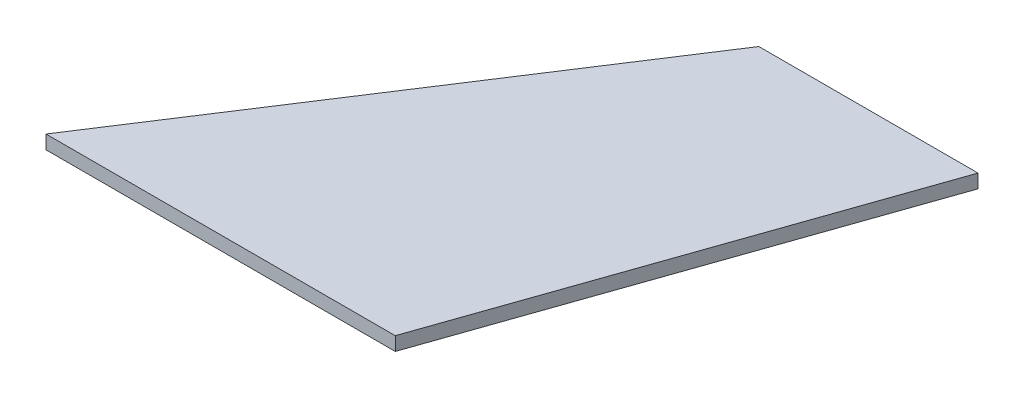
ISO-10303-21;
HEADER;
FILE_DESCRIPTION(('STEP AP214'),'2;1');
FILE_NAME('part.step','',(''),(''),'','','');
FILE_SCHEMA(('AUTOMOTIVE_DESIGN { 1 0 10303 214 1 1 1 1 }'));
ENDSEC;
DATA;
#1=APPLICATION_CONTEXT('core data for automotive mechanical design processes');
#2=APPLICATION_PROTOCOL_DEFINITION('international standard','automotive_design',2000,#1);
#3=PRODUCT_CONTEXT('',#1,'mechanical');
#4=PRODUCT('Part','Part','',(#3));
#5=PRODUCT_RELATED_PRODUCT_CATEGORY('part','',(#4));
#6=PRODUCT_DEFINITION_FORMATION('','',#4);
#7=PRODUCT_DEFINITION_CONTEXT('part definition',#1,'design');
#8=PRODUCT_DEFINITION('design','',#6,#7);
#9=PRODUCT_DEFINITION_SHAPE('','',#8);
#10=(LENGTH_UNIT() NAMED_UNIT(*) SI_UNIT(.MILLI.,.METRE.));
#11=(NAMED_UNIT(*) PLANE_ANGLE_UNIT() SI_UNIT($,.RADIAN.));
#12=(NAMED_UNIT(*) SI_UNIT($,.STERADIAN.) SOLID_ANGLE_UNIT());
#13=UNCERTAINTY_MEASURE_WITH_UNIT(LENGTH_MEASURE(1.E-05),#10,'distance_accuracy_value','');
#14=(GEOMETRIC_REPRESENTATION_CONTEXT(3) GLOBAL_UNCERTAINTY_ASSIGNED_CONTEXT((#13)) GLOBAL_UNIT_ASSIGNED_CONTEXT((#10,
#11,#12)) REPRESENTATION_CONTEXT('',''));
#15=CARTESIAN_POINT('',(0.,0.,0.));
#16=DIRECTION('',(0.,0.,1.));
#17=DIRECTION('',(1.,0.,0.));
#18=AXIS2_PLACEMENT_3D('',#15,#16,#17);
#19=CARTESIAN_POINT('',(0.,1.,0.));
#20=DIRECTION('',(-0.838670567945425,0.,-0.544639035015025));
#21=DIRECTION('',(-0.544639035015025,0.,0.838670567945425));
#22=AXIS2_PLACEMENT_3D('',#19,#20,#21);
#23=PLANE('',#22);
#24=DIRECTION('',(0.544639035015025,0.,-0.838670567945425));
#25=VECTOR('',#24,1.);
#26=CARTESIAN_POINT('',(0.,-1.,0.));
#27=LINE('',#26,#25);
#28=CARTESIAN_POINT('',(0.,-1.,0.));
#29=VERTEX_POINT('',#28);
#30=CARTESIAN_POINT('',(40.9837172018699,-1.,-63.1093902060448));
#31=VERTEX_POINT('',#30);
#32=EDGE_CURVE('E100',#29,#31,#27,.T.);
#33=ORIENTED_EDGE('',*,*,#32,.F.);
#34=DIRECTION('',(0.,-1.,0.));
#35=VECTOR('',#34,1.);
#36=CARTESIAN_POINT('',(0.,1.,0.));
#37=LINE('',#36,#35);
#38=CARTESIAN_POINT('',(0.,1.,0.));
#39=VERTEX_POINT('',#38);
#40=EDGE_CURVE('E11',#39,#29,#37,.T.);
#41=ORIENTED_EDGE('',*,*,#40,.F.);
#42=DIRECTION('',(0.544639035015025,0.,-0.838670567945425));
#43=VECTOR('',#42,1.);
#44=CARTESIAN_POINT('',(0.,1.,0.));
#45=LINE('',#44,#43);
#46=CARTESIAN_POINT('',(40.9837172018699,1.,-63.1093902060448));
#47=VERTEX_POINT('',#46);
#48=EDGE_CURVE('E95',#39,#47,#45,.T.);
#49=ORIENTED_EDGE('',*,*,#48,.T.);
#50=DIRECTION('',(0.,-1.,0.));
#51=VECTOR('',#50,1.);
#52=CARTESIAN_POINT('',(40.9837172018699,1.,-63.1093902060448));
#53=LINE('',#52,#51);
#54=EDGE_CURVE('E38',#47,#31,#53,.T.);
#55=ORIENTED_EDGE('',*,*,#54,.T.);
#56=EDGE_LOOP('',(#33,#41,#49,#55));
#57=FACE_BOUND('',#56,.T.);
#58=ADVANCED_FACE('F35',(#57),#23,.T.);
#59=CARTESIAN_POINT('',(0.,1.,0.));
#60=DIRECTION('',(0.,0.,-1.));
#61=DIRECTION('',(-1.,0.,0.));
#62=AXIS2_PLACEMENT_3D('',#59,#60,#61);
#63=PLANE('',#62);
#64=DIRECTION('',(1.,0.,0.));
#65=VECTOR('',#64,1.);
#66=CARTESIAN_POINT('',(0.,-1.,0.));
#67=LINE('',#66,#65);
#68=CARTESIAN_POINT('',(51.,-1.,0.));
#69=VERTEX_POINT('',#68);
#70=EDGE_CURVE('E68',#29,#69,#67,.T.);
#71=ORIENTED_EDGE('',*,*,#70,.T.);
#72=DIRECTION('',(0.,-1.,0.));
#73=VECTOR('',#72,1.);
#74=CARTESIAN_POINT('',(51.,1.,0.));
#75=LINE('',#74,#73);
#76=CARTESIAN_POINT('',(51.,1.,0.));
#77=VERTEX_POINT('',#76);
#78=EDGE_CURVE('E44',#77,#69,#75,.T.);
#79=ORIENTED_EDGE('',*,*,#78,.F.);
#80=DIRECTION('',(1.,0.,0.));
#81=VECTOR('',#80,1.);
#82=CARTESIAN_POINT('',(0.,1.,0.));
#83=LINE('',#82,#81);
#84=EDGE_CURVE('E85',#39,#77,#83,.T.);
#85=ORIENTED_EDGE('',*,*,#84,.F.);
#86=ORIENTED_EDGE('',*,*,#40,.T.);
#87=EDGE_LOOP('',(#71,#79,#85,#86));
#88=FACE_BOUND('',#87,.T.);
#89=ADVANCED_FACE('F110',(#88),#63,.F.);
#90=CARTESIAN_POINT('',(51.,1.,0.));
#91=DIRECTION('',(-0.944345218196315,0.,-0.328956089576943));
#92=DIRECTION('',(-0.328956089576943,0.,0.944345218196315));
#93=AXIS2_PLACEMENT_3D('',#90,#91,#92);
#94=PLANE('',#93);
#95=DIRECTION('',(0.328956089576943,0.,-0.944345218196315));
#96=VECTOR('',#95,1.);
#97=CARTESIAN_POINT('',(51.,-1.,0.));
#98=LINE('',#97,#96);
#99=CARTESIAN_POINT('',(72.9837172018699,-1.,-63.1093902060448));
#100=VERTEX_POINT('',#99);
#101=EDGE_CURVE('E92',#69,#100,#98,.T.);
#102=ORIENTED_EDGE('',*,*,#101,.T.);
#103=DIRECTION('',(0.,-1.,0.));
#104=VECTOR('',#103,1.);
#105=CARTESIAN_POINT('',(72.9837172018699,1.,-63.1093902060448));
#106=LINE('',#105,#104);
#107=CARTESIAN_POINT('',(72.9837172018699,1.,-63.1093902060448));
#108=VERTEX_POINT('',#107);
#109=EDGE_CURVE('E89',#108,#100,#106,.T.);
#110=ORIENTED_EDGE('',*,*,#109,.F.);
#111=DIRECTION('',(0.328956089576943,0.,-0.944345218196315));
#112=VECTOR('',#111,1.);
#113=CARTESIAN_POINT('',(51.,1.,0.));
#114=LINE('',#113,#112);
#115=EDGE_CURVE('E80',#77,#108,#114,.T.);
#116=ORIENTED_EDGE('',*,*,#115,.F.);
#117=ORIENTED_EDGE('',*,*,#78,.T.);
#118=EDGE_LOOP('',(#102,#110,#116,#117));
#119=FACE_BOUND('',#118,.T.);
#120=ADVANCED_FACE('F90',(#119),#94,.F.);
#121=CARTESIAN_POINT('',(40.9837172018699,1.,-63.1093902060448));
#122=DIRECTION('',(0.,0.,-1.));
#123=DIRECTION('',(-1.,0.,0.));
#124=AXIS2_PLACEMENT_3D('',#121,#122,#123);
#125=PLANE('',#124);
#126=DIRECTION('',(1.,0.,0.));
#127=VECTOR('',#126,1.);
#128=CARTESIAN_POINT('',(40.9837172018699,-1.,-63.1093902060448));
#129=LINE('',#128,#127);
#130=EDGE_CURVE('E103',#31,#100,#129,.T.);
#131=ORIENTED_EDGE('',*,*,#130,.F.);
#132=ORIENTED_EDGE('',*,*,#54,.F.);
#133=DIRECTION('',(1.,0.,0.));
#134=VECTOR('',#133,1.);
#135=CARTESIAN_POINT('',(40.9837172018699,1.,-63.1093902060448));
#136=LINE('',#135,#134);
#137=EDGE_CURVE('E84',#47,#108,#136,.T.);
#138=ORIENTED_EDGE('',*,*,#137,.T.);
#139=ORIENTED_EDGE('',*,*,#109,.T.);
#140=EDGE_LOOP('',(#131,#132,#138,#139));
#141=FACE_BOUND('',#140,.T.);
#142=ADVANCED_FACE('F94',(#141),#125,.T.);
#143=CARTESIAN_POINT('',(0.,1.,0.));
#144=DIRECTION('',(0.,-1.,0.));
#145=DIRECTION('',(0.,0.,-1.));
#146=AXIS2_PLACEMENT_3D('',#143,#144,#145);
#147=PLANE('',#146);
#148=ORIENTED_EDGE('',*,*,#48,.F.);
#149=ORIENTED_EDGE('',*,*,#84,.T.);
#150=ORIENTED_EDGE('',*,*,#115,.T.);
#151=ORIENTED_EDGE('',*,*,#137,.F.);
#152=EDGE_LOOP('',(#148,#149,#150,#151));
#153=FACE_BOUND('',#152,.T.);
#154=ADVANCED_FACE('F83',(#153),#147,.F.);
#155=CARTESIAN_POINT('',(0.,-1.,0.));
#156=DIRECTION('',(0.,-1.,0.));
#157=DIRECTION('',(0.,0.,-1.));
#158=AXIS2_PLACEMENT_3D('',#155,#156,#157);
#159=PLANE('',#158);
#160=ORIENTED_EDGE('',*,*,#32,.T.);
#161=ORIENTED_EDGE('',*,*,#130,.T.);
#162=ORIENTED_EDGE('',*,*,#101,.F.);
#163=ORIENTED_EDGE('',*,*,#70,.F.);
#164=EDGE_LOOP('',(#160,#161,#162,#163));
#165=FACE_BOUND('',#164,.T.);
#166=ADVANCED_FACE('F108',(#165),#159,.T.);
#167=CLOSED_SHELL('',(#58,#89,#120,#142,#154,#166));
#168=MANIFOLD_SOLID_BREP('B2',#167);
#169=ADVANCED_BREP_SHAPE_REPRESENTATION('',(#18,#168),#14);
#170=SHAPE_DEFINITION_REPRESENTATION(#9,#169);
ENDSEC;
END-ISO-10303-21;
